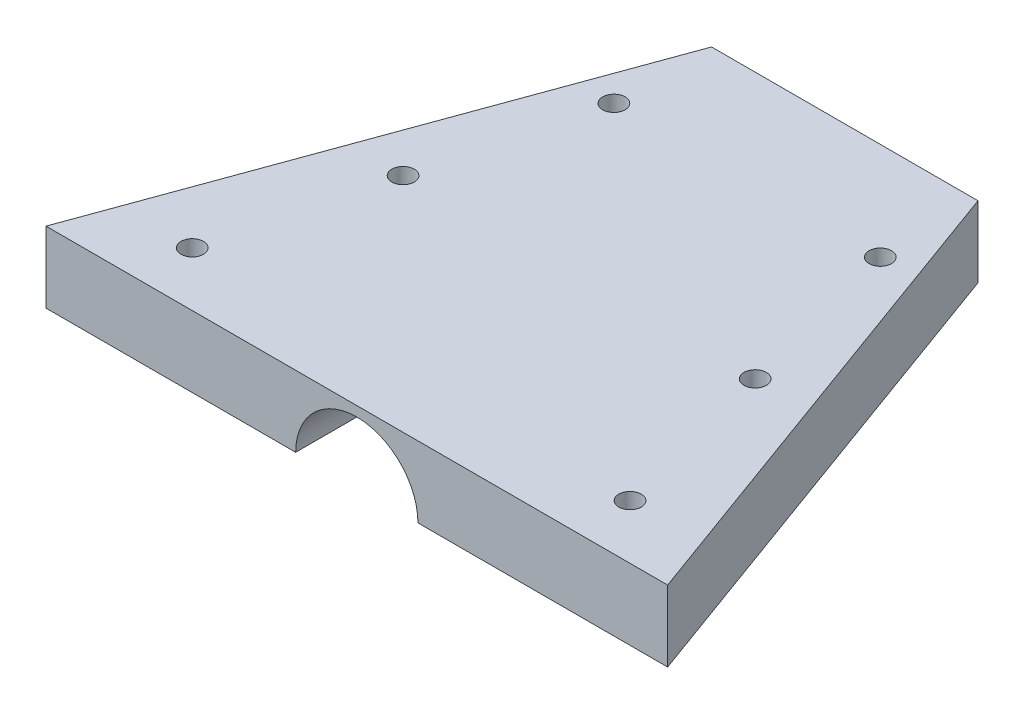
ISO-10303-21;
HEADER;
FILE_DESCRIPTION(('STEP AP214'),'2;1');
FILE_NAME('part.step','',(''),(''),'','','');
FILE_SCHEMA(('AUTOMOTIVE_DESIGN { 1 0 10303 214 1 1 1 1 }'));
ENDSEC;
DATA;
#1=APPLICATION_CONTEXT('core data for automotive mechanical design processes');
#2=APPLICATION_PROTOCOL_DEFINITION('international standard','automotive_design',2000,#1);
#3=PRODUCT_CONTEXT('',#1,'mechanical');
#4=PRODUCT('Part','Part','',(#3));
#5=PRODUCT_RELATED_PRODUCT_CATEGORY('part','',(#4));
#6=PRODUCT_DEFINITION_FORMATION('','',#4);
#7=PRODUCT_DEFINITION_CONTEXT('part definition',#1,'design');
#8=PRODUCT_DEFINITION('design','',#6,#7);
#9=PRODUCT_DEFINITION_SHAPE('','',#8);
#10=(LENGTH_UNIT() NAMED_UNIT(*) SI_UNIT(.MILLI.,.METRE.));
#11=(NAMED_UNIT(*) PLANE_ANGLE_UNIT() SI_UNIT($,.RADIAN.));
#12=(NAMED_UNIT(*) SI_UNIT($,.STERADIAN.) SOLID_ANGLE_UNIT());
#13=UNCERTAINTY_MEASURE_WITH_UNIT(LENGTH_MEASURE(1.E-05),#10,'distance_accuracy_value','');
#14=(GEOMETRIC_REPRESENTATION_CONTEXT(3) GLOBAL_UNCERTAINTY_ASSIGNED_CONTEXT((#13)) GLOBAL_UNIT_ASSIGNED_CONTEXT((#10,
#11,#12)) REPRESENTATION_CONTEXT('',''));
#15=CARTESIAN_POINT('',(0.,0.,0.));
#16=DIRECTION('',(0.,0.,1.));
#17=DIRECTION('',(1.,0.,0.));
#18=AXIS2_PLACEMENT_3D('',#15,#16,#17);
#19=CARTESIAN_POINT('',(0.,0.,0.));
#20=DIRECTION('',(0.,-1.,0.));
#21=DIRECTION('',(0.,0.,-1.));
#22=AXIS2_PLACEMENT_3D('',#19,#20,#21);
#23=PLANE('',#22);
#24=CARTESIAN_POINT('',(22.8130859440281,0.,43.049100152102));
#25=DIRECTION('',(0.,1.,0.));
#26=DIRECTION('',(0.,0.,1.));
#27=AXIS2_PLACEMENT_3D('',#24,#25,#26);
#28=CIRCLE('',#27,1.26365);
#29=CARTESIAN_POINT('',(22.8130859440281,0.,44.312750152102));
#30=VERTEX_POINT('',#29);
#31=EDGE_CURVE('E175',#30,#30,#28,.T.);
#32=ORIENTED_EDGE('',*,*,#31,.T.);
#33=EDGE_LOOP('',(#32));
#34=FACE_BOUND('',#33,.T.);
#35=CARTESIAN_POINT('',(13.163085944028,0.,5.21664648822295));
#36=DIRECTION('',(0.,1.,0.));
#37=DIRECTION('',(0.,0.,1.));
#38=AXIS2_PLACEMENT_3D('',#35,#36,#37);
#39=CIRCLE('',#38,1.26365);
#40=CARTESIAN_POINT('',(13.163085944028,0.,6.48029648822295));
#41=VERTEX_POINT('',#40);
#42=EDGE_CURVE('E157',#41,#41,#39,.T.);
#43=ORIENTED_EDGE('',*,*,#42,.T.);
#44=EDGE_LOOP('',(#43));
#45=FACE_BOUND('',#44,.T.);
#46=CARTESIAN_POINT('',(17.9880859440281,0.,24.1328733201625));
#47=DIRECTION('',(0.,1.,0.));
#48=DIRECTION('',(0.,0.,1.));
#49=AXIS2_PLACEMENT_3D('',#46,#47,#48);
#50=CIRCLE('',#49,1.26365);
#51=CARTESIAN_POINT('',(17.9880859440281,0.,25.3965233201625));
#52=VERTEX_POINT('',#51);
#53=EDGE_CURVE('E106',#52,#52,#50,.T.);
#54=ORIENTED_EDGE('',*,*,#53,.T.);
#55=EDGE_LOOP('',(#54));
#56=FACE_BOUND('',#55,.T.);
#57=DIRECTION('',(0.,0.,1.));
#58=VECTOR('',#57,1.);
#59=CARTESIAN_POINT('',(5.04769268169056,0.,-38.833805122684));
#60=LINE('',#59,#58);
#61=CARTESIAN_POINT('',(5.04769268169056,0.,-5.78335351177704));
#62=VERTEX_POINT('',#61);
#63=CARTESIAN_POINT('',(5.04769268169056,0.,49.166194877316));
#64=VERTEX_POINT('',#63);
#65=EDGE_CURVE('E11',#62,#64,#60,.T.);
#66=ORIENTED_EDGE('',*,*,#65,.F.);
#67=DIRECTION('',(1.,0.,0.));
#68=VECTOR('',#67,1.);
#69=CARTESIAN_POINT('',(-16.8369140559719,0.,-5.78335351177704));
#70=LINE('',#69,#68);
#71=CARTESIAN_POINT('',(13.163085944028,0.,-5.78335351177704));
#72=VERTEX_POINT('',#71);
#73=EDGE_CURVE('E112',#62,#72,#70,.T.);
#74=ORIENTED_EDGE('',*,*,#73,.T.);
#75=DIRECTION('',(0.342020143325666,0.,0.939692620785909));
#76=VECTOR('',#75,1.);
#77=CARTESIAN_POINT('',(13.163085944028,0.,-5.78335351177704));
#78=LINE('',#77,#76);
#79=CARTESIAN_POINT('',(33.1630859440281,0.,49.166194877316));
#80=VERTEX_POINT('',#79);
#81=EDGE_CURVE('E108',#72,#80,#78,.T.);
#82=ORIENTED_EDGE('',*,*,#81,.T.);
#83=DIRECTION('',(-1.,0.,0.));
#84=VECTOR('',#83,1.);
#85=CARTESIAN_POINT('',(33.1630859440281,0.,49.166194877316));
#86=LINE('',#85,#84);
#87=EDGE_CURVE('E103',#80,#64,#86,.T.);
#88=ORIENTED_EDGE('',*,*,#87,.T.);
#89=EDGE_LOOP('',(#66,#74,#82,#88));
#90=FACE_BOUND('',#89,.T.);
#91=ADVANCED_FACE('F36',(#34,#45,#56,#90),#23,.T.);
#92=CARTESIAN_POINT('',(33.1630859440281,8.,49.166194877316));
#93=DIRECTION('',(0.,0.,1.));
#94=DIRECTION('',(1.,0.,0.));
#95=AXIS2_PLACEMENT_3D('',#92,#93,#94);
#96=PLANE('',#95);
#97=CARTESIAN_POINT('',(-1.83691405597191,0.,49.166194877316));
#98=DIRECTION('',(0.,0.,1.));
#99=DIRECTION('',(1.,0.,0.));
#100=AXIS2_PLACEMENT_3D('',#97,#98,#99);
#101=CIRCLE('',#100,6.88460673766247);
#102=CARTESIAN_POINT('',(-8.72152079363438,0.,49.166194877316));
#103=VERTEX_POINT('',#102);
#104=EDGE_CURVE('E50',#64,#103,#101,.T.);
#105=ORIENTED_EDGE('',*,*,#104,.F.);
#106=ORIENTED_EDGE('',*,*,#87,.F.);
#107=DIRECTION('',(0.,-1.,0.));
#108=VECTOR('',#107,1.);
#109=CARTESIAN_POINT('',(33.1630859440281,8.,49.166194877316));
#110=LINE('',#109,#108);
#111=CARTESIAN_POINT('',(33.1630859440281,8.,49.166194877316));
#112=VERTEX_POINT('',#111);
#113=EDGE_CURVE('E59',#112,#80,#110,.T.);
#114=ORIENTED_EDGE('',*,*,#113,.F.);
#115=DIRECTION('',(-1.,0.,0.));
#116=VECTOR('',#115,1.);
#117=CARTESIAN_POINT('',(33.1630859440281,8.,49.166194877316));
#118=LINE('',#117,#116);
#119=CARTESIAN_POINT('',(-36.8369140559719,8.,49.166194877316));
#120=VERTEX_POINT('',#119);
#121=EDGE_CURVE('E122',#112,#120,#118,.T.);
#122=ORIENTED_EDGE('',*,*,#121,.T.);
#123=DIRECTION('',(0.,-1.,0.));
#124=VECTOR('',#123,1.);
#125=CARTESIAN_POINT('',(-36.8369140559719,8.,49.166194877316));
#126=LINE('',#125,#124);
#127=CARTESIAN_POINT('',(-36.8369140559719,0.,49.166194877316));
#128=VERTEX_POINT('',#127);
#129=EDGE_CURVE('E86',#120,#128,#126,.T.);
#130=ORIENTED_EDGE('',*,*,#129,.T.);
#131=EDGE_CURVE('E105',#103,#128,#86,.T.);
#132=ORIENTED_EDGE('',*,*,#131,.F.);
#133=EDGE_LOOP('',(#105,#106,#114,#122,#130,#132));
#134=FACE_BOUND('',#133,.T.);
#135=ADVANCED_FACE('F38',(#134),#96,.T.);
#136=CARTESIAN_POINT('',(13.163085944028,8.,-5.78335351177704));
#137=DIRECTION('',(0.939692620785909,0.,-0.342020143325666));
#138=DIRECTION('',(-0.342020143325666,0.,-0.93969262078591));
#139=AXIS2_PLACEMENT_3D('',#136,#137,#138);
#140=PLANE('',#139);
#141=ORIENTED_EDGE('',*,*,#81,.F.);
#142=DIRECTION('',(0.,-1.,0.));
#143=VECTOR('',#142,1.);
#144=CARTESIAN_POINT('',(13.163085944028,8.,-5.78335351177704));
#145=LINE('',#144,#143);
#146=CARTESIAN_POINT('',(13.163085944028,8.,-5.78335351177704));
#147=VERTEX_POINT('',#146);
#148=EDGE_CURVE('E124',#147,#72,#145,.T.);
#149=ORIENTED_EDGE('',*,*,#148,.F.);
#150=DIRECTION('',(0.342020143325666,0.,0.939692620785909));
#151=VECTOR('',#150,1.);
#152=CARTESIAN_POINT('',(13.163085944028,8.,-5.78335351177704));
#153=LINE('',#152,#151);
#154=EDGE_CURVE('E115',#147,#112,#153,.T.);
#155=ORIENTED_EDGE('',*,*,#154,.T.);
#156=ORIENTED_EDGE('',*,*,#113,.T.);
#157=EDGE_LOOP('',(#141,#149,#155,#156));
#158=FACE_BOUND('',#157,.T.);
#159=ADVANCED_FACE('F217',(#158),#140,.T.);
#160=CARTESIAN_POINT('',(-16.8369140559719,8.,-5.78335351177704));
#161=DIRECTION('',(0.,0.,-1.));
#162=DIRECTION('',(-1.,0.,0.));
#163=AXIS2_PLACEMENT_3D('',#160,#161,#162);
#164=PLANE('',#163);
#165=CARTESIAN_POINT('',(-1.83691405597191,0.,-5.78335351177704));
#166=DIRECTION('',(0.,0.,-1.));
#167=DIRECTION('',(-1.,0.,0.));
#168=AXIS2_PLACEMENT_3D('',#165,#166,#167);
#169=CIRCLE('',#168,6.88460673766247);
#170=CARTESIAN_POINT('',(-8.72152079363438,0.,-5.78335351177704));
#171=VERTEX_POINT('',#170);
#172=EDGE_CURVE('E98',#171,#62,#169,.T.);
#173=ORIENTED_EDGE('',*,*,#172,.F.);
#174=CARTESIAN_POINT('',(-16.8369140559719,0.,-5.78335351177704));
#175=VERTEX_POINT('',#174);
#176=EDGE_CURVE('E118',#175,#171,#70,.T.);
#177=ORIENTED_EDGE('',*,*,#176,.F.);
#178=DIRECTION('',(0.,-1.,0.));
#179=VECTOR('',#178,1.);
#180=CARTESIAN_POINT('',(-16.8369140559719,8.,-5.78335351177704));
#181=LINE('',#180,#179);
#182=CARTESIAN_POINT('',(-16.8369140559719,8.,-5.78335351177704));
#183=VERTEX_POINT('',#182);
#184=EDGE_CURVE('E127',#183,#175,#181,.T.);
#185=ORIENTED_EDGE('',*,*,#184,.F.);
#186=DIRECTION('',(1.,0.,0.));
#187=VECTOR('',#186,1.);
#188=CARTESIAN_POINT('',(-16.8369140559719,8.,-5.78335351177704));
#189=LINE('',#188,#187);
#190=EDGE_CURVE('E139',#183,#147,#189,.T.);
#191=ORIENTED_EDGE('',*,*,#190,.T.);
#192=ORIENTED_EDGE('',*,*,#148,.T.);
#193=ORIENTED_EDGE('',*,*,#73,.F.);
#194=EDGE_LOOP('',(#173,#177,#185,#191,#192,#193));
#195=FACE_BOUND('',#194,.T.);
#196=ADVANCED_FACE('F132',(#195),#164,.T.);
#197=CARTESIAN_POINT('',(-36.8369140559719,8.,49.166194877316));
#198=DIRECTION('',(-0.93969262078591,0.,-0.342020143325665));
#199=DIRECTION('',(-0.342020143325665,0.,0.93969262078591));
#200=AXIS2_PLACEMENT_3D('',#197,#198,#199);
#201=PLANE('',#200);
#202=DIRECTION('',(0.342020143325665,0.,-0.93969262078591));
#203=VECTOR('',#202,1.);
#204=CARTESIAN_POINT('',(-36.8369140559719,0.,49.166194877316));
#205=LINE('',#204,#203);
#206=EDGE_CURVE('E109',#128,#175,#205,.T.);
#207=ORIENTED_EDGE('',*,*,#206,.F.);
#208=ORIENTED_EDGE('',*,*,#129,.F.);
#209=DIRECTION('',(0.342020143325665,0.,-0.93969262078591));
#210=VECTOR('',#209,1.);
#211=CARTESIAN_POINT('',(-36.8369140559719,8.,49.166194877316));
#212=LINE('',#211,#210);
#213=EDGE_CURVE('E136',#120,#183,#212,.T.);
#214=ORIENTED_EDGE('',*,*,#213,.T.);
#215=ORIENTED_EDGE('',*,*,#184,.T.);
#216=EDGE_LOOP('',(#207,#208,#214,#215));
#217=FACE_BOUND('',#216,.T.);
#218=ADVANCED_FACE('F135',(#217),#201,.T.);
#219=CARTESIAN_POINT('',(0.,8.,0.));
#220=DIRECTION('',(0.,-1.,0.));
#221=DIRECTION('',(0.,0.,-1.));
#222=AXIS2_PLACEMENT_3D('',#219,#220,#221);
#223=PLANE('',#222);
#224=CARTESIAN_POINT('',(22.8130859440281,8.,43.049100152102));
#225=DIRECTION('',(0.,1.,0.));
#226=DIRECTION('',(0.,0.,1.));
#227=AXIS2_PLACEMENT_3D('',#224,#225,#226);
#228=CIRCLE('',#227,1.26365);
#229=CARTESIAN_POINT('',(22.8130859440281,8.,44.312750152102));
#230=VERTEX_POINT('',#229);
#231=EDGE_CURVE('E178',#230,#230,#228,.T.);
#232=ORIENTED_EDGE('',*,*,#231,.F.);
#233=EDGE_LOOP('',(#232));
#234=FACE_BOUND('',#233,.T.);
#235=CARTESIAN_POINT('',(-26.4869140559719,8.,43.049100152102));
#236=DIRECTION('',(0.,1.,0.));
#237=DIRECTION('',(0.,0.,1.));
#238=AXIS2_PLACEMENT_3D('',#235,#236,#237);
#239=CIRCLE('',#238,1.26365);
#240=CARTESIAN_POINT('',(-26.4869140559719,8.,44.312750152102));
#241=VERTEX_POINT('',#240);
#242=EDGE_CURVE('E172',#241,#241,#239,.T.);
#243=ORIENTED_EDGE('',*,*,#242,.F.);
#244=EDGE_LOOP('',(#243));
#245=FACE_BOUND('',#244,.T.);
#246=CARTESIAN_POINT('',(-16.8369140559719,8.,5.21664648822296));
#247=DIRECTION('',(0.,1.,0.));
#248=DIRECTION('',(0.,0.,1.));
#249=AXIS2_PLACEMENT_3D('',#246,#247,#248);
#250=CIRCLE('',#249,1.26365);
#251=CARTESIAN_POINT('',(-16.8369140559719,8.,6.48029648822296));
#252=VERTEX_POINT('',#251);
#253=EDGE_CURVE('E166',#252,#252,#250,.T.);
#254=ORIENTED_EDGE('',*,*,#253,.F.);
#255=EDGE_LOOP('',(#254));
#256=FACE_BOUND('',#255,.T.);
#257=CARTESIAN_POINT('',(13.163085944028,8.,5.21664648822295));
#258=DIRECTION('',(0.,1.,0.));
#259=DIRECTION('',(0.,0.,1.));
#260=AXIS2_PLACEMENT_3D('',#257,#258,#259);
#261=CIRCLE('',#260,1.26365);
#262=CARTESIAN_POINT('',(13.163085944028,8.,6.48029648822295));
#263=VERTEX_POINT('',#262);
#264=EDGE_CURVE('E160',#263,#263,#261,.T.);
#265=ORIENTED_EDGE('',*,*,#264,.F.);
#266=EDGE_LOOP('',(#265));
#267=FACE_BOUND('',#266,.T.);
#268=CARTESIAN_POINT('',(-21.6619140559719,8.,24.1328733201625));
#269=DIRECTION('',(0.,1.,0.));
#270=DIRECTION('',(0.,0.,1.));
#271=AXIS2_PLACEMENT_3D('',#268,#269,#270);
#272=CIRCLE('',#271,1.26365);
#273=CARTESIAN_POINT('',(-21.6619140559719,8.,25.3965233201625));
#274=VERTEX_POINT('',#273);
#275=EDGE_CURVE('E154',#274,#274,#272,.T.);
#276=ORIENTED_EDGE('',*,*,#275,.F.);
#277=EDGE_LOOP('',(#276));
#278=FACE_BOUND('',#277,.T.);
#279=CARTESIAN_POINT('',(17.9880859440281,8.,24.1328733201625));
#280=DIRECTION('',(0.,1.,0.));
#281=DIRECTION('',(0.,0.,1.));
#282=AXIS2_PLACEMENT_3D('',#279,#280,#281);
#283=CIRCLE('',#282,1.26365);
#284=CARTESIAN_POINT('',(17.9880859440281,8.,25.3965233201625));
#285=VERTEX_POINT('',#284);
#286=EDGE_CURVE('E148',#285,#285,#283,.T.);
#287=ORIENTED_EDGE('',*,*,#286,.F.);
#288=EDGE_LOOP('',(#287));
#289=FACE_BOUND('',#288,.T.);
#290=ORIENTED_EDGE('',*,*,#121,.F.);
#291=ORIENTED_EDGE('',*,*,#154,.F.);
#292=ORIENTED_EDGE('',*,*,#190,.F.);
#293=ORIENTED_EDGE('',*,*,#213,.F.);
#294=EDGE_LOOP('',(#290,#291,#292,#293));
#295=FACE_BOUND('',#294,.T.);
#296=ADVANCED_FACE('F142',(#234,#245,#256,#267,#278,#289,#295),#223,.F.);
#297=CARTESIAN_POINT('',(-26.4869140559719,0.,43.049100152102));
#298=DIRECTION('',(0.,1.,0.));
#299=DIRECTION('',(0.,0.,1.));
#300=AXIS2_PLACEMENT_3D('',#297,#298,#299);
#301=CIRCLE('',#300,1.26365);
#302=CARTESIAN_POINT('',(-26.4869140559719,0.,44.312750152102));
#303=VERTEX_POINT('',#302);
#304=EDGE_CURVE('E169',#303,#303,#301,.T.);
#305=ORIENTED_EDGE('',*,*,#304,.T.);
#306=EDGE_LOOP('',(#305));
#307=FACE_BOUND('',#306,.T.);
#308=CARTESIAN_POINT('',(-16.8369140559719,0.,5.21664648822296));
#309=DIRECTION('',(0.,1.,0.));
#310=DIRECTION('',(0.,0.,1.));
#311=AXIS2_PLACEMENT_3D('',#308,#309,#310);
#312=CIRCLE('',#311,1.26365);
#313=CARTESIAN_POINT('',(-16.8369140559719,0.,6.48029648822296));
#314=VERTEX_POINT('',#313);
#315=EDGE_CURVE('E163',#314,#314,#312,.T.);
#316=ORIENTED_EDGE('',*,*,#315,.T.);
#317=EDGE_LOOP('',(#316));
#318=FACE_BOUND('',#317,.T.);
#319=CARTESIAN_POINT('',(-21.6619140559719,0.,24.1328733201625));
#320=DIRECTION('',(0.,1.,0.));
#321=DIRECTION('',(0.,0.,1.));
#322=AXIS2_PLACEMENT_3D('',#319,#320,#321);
#323=CIRCLE('',#322,1.26365);
#324=CARTESIAN_POINT('',(-21.6619140559719,0.,25.3965233201625));
#325=VERTEX_POINT('',#324);
#326=EDGE_CURVE('E151',#325,#325,#323,.T.);
#327=ORIENTED_EDGE('',*,*,#326,.T.);
#328=EDGE_LOOP('',(#327));
#329=FACE_BOUND('',#328,.T.);
#330=DIRECTION('',(0.,0.,1.));
#331=VECTOR('',#330,1.);
#332=CARTESIAN_POINT('',(-8.72152079363438,0.,-38.833805122684));
#333=LINE('',#332,#331);
#334=EDGE_CURVE('E44',#103,#171,#333,.F.);
#335=ORIENTED_EDGE('',*,*,#334,.F.);
#336=ORIENTED_EDGE('',*,*,#131,.T.);
#337=ORIENTED_EDGE('',*,*,#206,.T.);
#338=ORIENTED_EDGE('',*,*,#176,.T.);
#339=EDGE_LOOP('',(#335,#336,#337,#338));
#340=FACE_BOUND('',#339,.T.);
#341=ADVANCED_FACE('F134',(#307,#318,#329,#340),#23,.T.);
#342=CARTESIAN_POINT('',(-1.83691405597191,0.,-38.833805122684));
#343=DIRECTION('',(0.,0.,1.));
#344=DIRECTION('',(1.,0.,0.));
#345=AXIS2_PLACEMENT_3D('',#342,#343,#344);
#346=CYLINDRICAL_SURFACE('',#345,6.88460673766247);
#347=ORIENTED_EDGE('',*,*,#65,.T.);
#348=ORIENTED_EDGE('',*,*,#104,.T.);
#349=ORIENTED_EDGE('',*,*,#334,.T.);
#350=ORIENTED_EDGE('',*,*,#172,.T.);
#351=EDGE_LOOP('',(#347,#348,#349,#350));
#352=FACE_BOUND('',#351,.T.);
#353=ADVANCED_FACE('F96',(#352),#346,.F.);
#354=CARTESIAN_POINT('',(17.9880859440281,8.,24.1328733201625));
#355=DIRECTION('',(0.,1.,0.));
#356=DIRECTION('',(0.,0.,1.));
#357=AXIS2_PLACEMENT_3D('',#354,#355,#356);
#358=CYLINDRICAL_SURFACE('',#357,1.26365);
#359=ORIENTED_EDGE('',*,*,#53,.F.);
#360=EDGE_LOOP('',(#359));
#361=FACE_BOUND('',#360,.T.);
#362=ORIENTED_EDGE('',*,*,#286,.T.);
#363=EDGE_LOOP('',(#362));
#364=FACE_BOUND('',#363,.T.);
#365=ADVANCED_FACE('F197',(#361,#364),#358,.F.);
#366=CARTESIAN_POINT('',(-21.6619140559719,8.,24.1328733201625));
#367=DIRECTION('',(0.,1.,0.));
#368=DIRECTION('',(0.,0.,1.));
#369=AXIS2_PLACEMENT_3D('',#366,#367,#368);
#370=CYLINDRICAL_SURFACE('',#369,1.26365);
#371=ORIENTED_EDGE('',*,*,#326,.F.);
#372=EDGE_LOOP('',(#371));
#373=FACE_BOUND('',#372,.T.);
#374=ORIENTED_EDGE('',*,*,#275,.T.);
#375=EDGE_LOOP('',(#374));
#376=FACE_BOUND('',#375,.T.);
#377=ADVANCED_FACE('F199',(#373,#376),#370,.F.);
#378=CARTESIAN_POINT('',(13.163085944028,8.,5.21664648822295));
#379=DIRECTION('',(0.,1.,0.));
#380=DIRECTION('',(0.,0.,1.));
#381=AXIS2_PLACEMENT_3D('',#378,#379,#380);
#382=CYLINDRICAL_SURFACE('',#381,1.26365);
#383=ORIENTED_EDGE('',*,*,#42,.F.);
#384=EDGE_LOOP('',(#383));
#385=FACE_BOUND('',#384,.T.);
#386=ORIENTED_EDGE('',*,*,#264,.T.);
#387=EDGE_LOOP('',(#386));
#388=FACE_BOUND('',#387,.T.);
#389=ADVANCED_FACE('F206',(#385,#388),#382,.F.);
#390=CARTESIAN_POINT('',(-16.8369140559719,8.,5.21664648822296));
#391=DIRECTION('',(0.,1.,0.));
#392=DIRECTION('',(0.,0.,1.));
#393=AXIS2_PLACEMENT_3D('',#390,#391,#392);
#394=CYLINDRICAL_SURFACE('',#393,1.26365);
#395=ORIENTED_EDGE('',*,*,#315,.F.);
#396=EDGE_LOOP('',(#395));
#397=FACE_BOUND('',#396,.T.);
#398=ORIENTED_EDGE('',*,*,#253,.T.);
#399=EDGE_LOOP('',(#398));
#400=FACE_BOUND('',#399,.T.);
#401=ADVANCED_FACE('F231',(#397,#400),#394,.F.);
#402=CARTESIAN_POINT('',(-26.4869140559719,8.,43.049100152102));
#403=DIRECTION('',(0.,1.,0.));
#404=DIRECTION('',(0.,0.,1.));
#405=AXIS2_PLACEMENT_3D('',#402,#403,#404);
#406=CYLINDRICAL_SURFACE('',#405,1.26365);
#407=ORIENTED_EDGE('',*,*,#304,.F.);
#408=EDGE_LOOP('',(#407));
#409=FACE_BOUND('',#408,.T.);
#410=ORIENTED_EDGE('',*,*,#242,.T.);
#411=EDGE_LOOP('',(#410));
#412=FACE_BOUND('',#411,.T.);
#413=ADVANCED_FACE('F234',(#409,#412),#406,.F.);
#414=CARTESIAN_POINT('',(22.8130859440281,8.,43.049100152102));
#415=DIRECTION('',(0.,1.,0.));
#416=DIRECTION('',(0.,0.,1.));
#417=AXIS2_PLACEMENT_3D('',#414,#415,#416);
#418=CYLINDRICAL_SURFACE('',#417,1.26365);
#419=ORIENTED_EDGE('',*,*,#31,.F.);
#420=EDGE_LOOP('',(#419));
#421=FACE_BOUND('',#420,.T.);
#422=ORIENTED_EDGE('',*,*,#231,.T.);
#423=EDGE_LOOP('',(#422));
#424=FACE_BOUND('',#423,.T.);
#425=ADVANCED_FACE('F182',(#421,#424),#418,.F.);
#426=CLOSED_SHELL('',(#91,#135,#159,#196,#218,#296,#341,#353,#365,#377,#389,#401,#413,#425));
#427=MANIFOLD_SOLID_BREP('B2',#426);
#428=ADVANCED_BREP_SHAPE_REPRESENTATION('',(#18,#427),#14);
#429=SHAPE_DEFINITION_REPRESENTATION(#9,#428);
ENDSEC;
END-ISO-10303-21;
